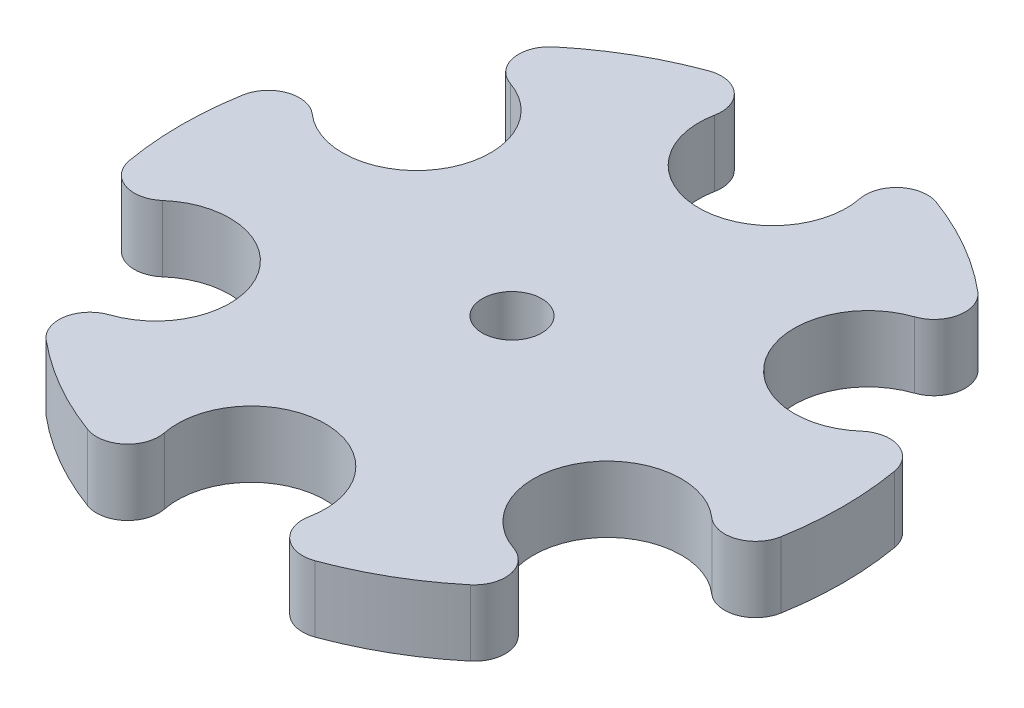
ISO-10303-21;
HEADER;
FILE_DESCRIPTION(('STEP AP214'),'2;1');
FILE_NAME('part.step','',(''),(''),'','','');
FILE_SCHEMA(('AUTOMOTIVE_DESIGN { 1 0 10303 214 1 1 1 1 }'));
ENDSEC;
DATA;
#1=APPLICATION_CONTEXT('core data for automotive mechanical design processes');
#2=APPLICATION_PROTOCOL_DEFINITION('international standard','automotive_design',2000,#1);
#3=PRODUCT_CONTEXT('',#1,'mechanical');
#4=PRODUCT('Part','Part','',(#3));
#5=PRODUCT_RELATED_PRODUCT_CATEGORY('part','',(#4));
#6=PRODUCT_DEFINITION_FORMATION('','',#4);
#7=PRODUCT_DEFINITION_CONTEXT('part definition',#1,'design');
#8=PRODUCT_DEFINITION('design','',#6,#7);
#9=PRODUCT_DEFINITION_SHAPE('','',#8);
#10=(LENGTH_UNIT() NAMED_UNIT(*) SI_UNIT(.MILLI.,.METRE.));
#11=(NAMED_UNIT(*) PLANE_ANGLE_UNIT() SI_UNIT($,.RADIAN.));
#12=(NAMED_UNIT(*) SI_UNIT($,.STERADIAN.) SOLID_ANGLE_UNIT());
#13=UNCERTAINTY_MEASURE_WITH_UNIT(LENGTH_MEASURE(1.E-05),#10,'distance_accuracy_value','');
#14=(GEOMETRIC_REPRESENTATION_CONTEXT(3) GLOBAL_UNCERTAINTY_ASSIGNED_CONTEXT((#13)) GLOBAL_UNIT_ASSIGNED_CONTEXT((#10,
#11,#12)) REPRESENTATION_CONTEXT('',''));
#15=CARTESIAN_POINT('',(0.,0.,0.));
#16=DIRECTION('',(0.,0.,1.));
#17=DIRECTION('',(1.,0.,0.));
#18=AXIS2_PLACEMENT_3D('',#15,#16,#17);
#19=CARTESIAN_POINT('',(-26.4735090378142,8.5,-72.3059701492537));
#20=DIRECTION('',(0.,-1.,0.));
#21=DIRECTION('',(0.,0.,-1.));
#22=AXIS2_PLACEMENT_3D('',#19,#20,#21);
#23=CYLINDRICAL_SURFACE('',#22,8.00000000000001);
#24=CARTESIAN_POINT('',(-26.4735090378142,-8.5,-72.3059701492537));
#25=DIRECTION('',(0.,1.,0.));
#26=DIRECTION('',(0.,0.,1.));
#27=AXIS2_PLACEMENT_3D('',#24,#25,#26);
#28=CIRCLE('',#27,8.00000000000001);
#29=CARTESIAN_POINT('',(-18.6295063599433,-8.5,-70.7338308457711));
#30=VERTEX_POINT('',#29);
#31=CARTESIAN_POINT('',(-29.2240034833014,-8.5,-79.8182787361891));
#32=VERTEX_POINT('',#31);
#33=EDGE_CURVE('E253',#30,#32,#28,.T.);
#34=ORIENTED_EDGE('',*,*,#33,.T.);
#35=DIRECTION('',(0.,-1.,0.));
#36=VECTOR('',#35,1.);
#37=CARTESIAN_POINT('',(-29.2240034833014,8.5,-79.8182787361891));
#38=LINE('',#37,#36);
#39=CARTESIAN_POINT('',(-29.2240034833014,8.5,-79.8182787361891));
#40=VERTEX_POINT('',#39);
#41=EDGE_CURVE('E12',#40,#32,#38,.T.);
#42=ORIENTED_EDGE('',*,*,#41,.F.);
#43=CARTESIAN_POINT('',(-26.4735090378142,8.5,-72.3059701492537));
#44=DIRECTION('',(0.,1.,0.));
#45=DIRECTION('',(0.,0.,1.));
#46=AXIS2_PLACEMENT_3D('',#43,#44,#45);
#47=CIRCLE('',#46,8.00000000000001);
#48=CARTESIAN_POINT('',(-18.6295063599433,8.5,-70.7338308457711));
#49=VERTEX_POINT('',#48);
#50=EDGE_CURVE('E381',#49,#40,#47,.T.);
#51=ORIENTED_EDGE('',*,*,#50,.F.);
#52=DIRECTION('',(0.,-1.,0.));
#53=VECTOR('',#52,1.);
#54=CARTESIAN_POINT('',(-18.6295063599433,8.5,-70.7338308457711));
#55=LINE('',#54,#53);
#56=EDGE_CURVE('E72',#49,#30,#55,.T.);
#57=ORIENTED_EDGE('',*,*,#56,.T.);
#58=EDGE_LOOP('',(#34,#42,#51,#57));
#59=FACE_BOUND('',#58,.T.);
#60=ADVANCED_FACE('F55',(#59),#23,.T.);
#61=CARTESIAN_POINT('',(0.,8.5,0.));
#62=DIRECTION('',(0.,-1.,0.));
#63=DIRECTION('',(0.,0.,-1.));
#64=AXIS2_PLACEMENT_3D('',#61,#62,#63);
#65=CYLINDRICAL_SURFACE('',#64,85.);
#66=CARTESIAN_POINT('',(0.,-8.5,0.));
#67=DIRECTION('',(0.,1.,0.));
#68=DIRECTION('',(0.,0.,1.));
#69=AXIS2_PLACEMENT_3D('',#66,#67,#68);
#70=CIRCLE('',#69,85.);
#71=CARTESIAN_POINT('',(-54.5126553302364,-8.5,-65.2178687849185));
#72=VERTEX_POINT('',#71);
#73=EDGE_CURVE('E255',#32,#72,#70,.T.);
#74=ORIENTED_EDGE('',*,*,#73,.T.);
#75=DIRECTION('',(0.,-1.,0.));
#76=VECTOR('',#75,1.);
#77=CARTESIAN_POINT('',(-54.5126553302364,8.5,-65.2178687849185));
#78=LINE('',#77,#76);
#79=CARTESIAN_POINT('',(-54.5126553302364,8.5,-65.2178687849185));
#80=VERTEX_POINT('',#79);
#81=EDGE_CURVE('E64',#80,#72,#78,.T.);
#82=ORIENTED_EDGE('',*,*,#81,.F.);
#83=CARTESIAN_POINT('',(0.,8.5,0.));
#84=DIRECTION('',(0.,1.,0.));
#85=DIRECTION('',(0.,0.,1.));
#86=AXIS2_PLACEMENT_3D('',#83,#84,#85);
#87=CIRCLE('',#86,85.);
#88=EDGE_CURVE('E158',#40,#80,#87,.T.);
#89=ORIENTED_EDGE('',*,*,#88,.F.);
#90=ORIENTED_EDGE('',*,*,#41,.T.);
#91=EDGE_LOOP('',(#74,#82,#89,#90));
#92=FACE_BOUND('',#91,.T.);
#93=ADVANCED_FACE('F365',(#92),#65,.T.);
#94=CARTESIAN_POINT('',(-49.3820524756259,8.5,-59.0797164286909));
#95=DIRECTION('',(0.,-1.,0.));
#96=DIRECTION('',(0.,0.,-1.));
#97=AXIS2_PLACEMENT_3D('',#94,#95,#96);
#98=CYLINDRICAL_SURFACE('',#97,7.99999999999998);
#99=CARTESIAN_POINT('',(-49.3820524756259,-8.5,-59.0797164286909));
#100=DIRECTION('',(0.,1.,0.));
#101=DIRECTION('',(0.,0.,1.));
#102=AXIS2_PLACEMENT_3D('',#99,#100,#101);
#103=CIRCLE('',#102,7.99999999999998);
#104=CARTESIAN_POINT('',(-51.9425412394574,-8.5,-51.5005411905602));
#105=VERTEX_POINT('',#104);
#106=EDGE_CURVE('E258',#105,#72,#103,.F.);
#107=ORIENTED_EDGE('',*,*,#106,.F.);
#108=DIRECTION('',(0.,-1.,0.));
#109=VECTOR('',#108,1.);
#110=CARTESIAN_POINT('',(-51.9425412394574,8.5,-51.5005411905602));
#111=LINE('',#110,#109);
#112=CARTESIAN_POINT('',(-51.9425412394574,8.5,-51.5005411905602));
#113=VERTEX_POINT('',#112);
#114=EDGE_CURVE('E358',#113,#105,#111,.T.);
#115=ORIENTED_EDGE('',*,*,#114,.F.);
#116=CARTESIAN_POINT('',(-49.3820524756259,8.5,-59.0797164286909));
#117=DIRECTION('',(0.,1.,0.));
#118=DIRECTION('',(0.,0.,1.));
#119=AXIS2_PLACEMENT_3D('',#116,#117,#118);
#120=CIRCLE('',#119,7.99999999999998);
#121=EDGE_CURVE('E364',#113,#80,#120,.F.);
#122=ORIENTED_EDGE('',*,*,#121,.T.);
#123=ORIENTED_EDGE('',*,*,#81,.T.);
#124=EDGE_LOOP('',(#107,#115,#122,#123));
#125=FACE_BOUND('',#124,.T.);
#126=ADVANCED_FACE('F362',(#125),#98,.T.);
#127=CARTESIAN_POINT('',(-58.0237020535574,8.5,-33.5));
#128=DIRECTION('',(0.,-1.,0.));
#129=DIRECTION('',(0.,0.,-1.));
#130=AXIS2_PLACEMENT_3D('',#127,#128,#129);
#131=CYLINDRICAL_SURFACE('',#130,19.);
#132=CARTESIAN_POINT('',(-58.0237020535574,-8.5,-33.5));
#133=DIRECTION('',(0.,1.,0.));
#134=DIRECTION('',(0.,0.,1.));
#135=AXIS2_PLACEMENT_3D('',#132,#133,#134);
#136=CIRCLE('',#135,19.);
#137=CARTESIAN_POINT('',(-70.5720475994007,-8.5,-19.2332896552109));
#138=VERTEX_POINT('',#137);
#139=EDGE_CURVE('E261',#138,#105,#136,.T.);
#140=ORIENTED_EDGE('',*,*,#139,.F.);
#141=DIRECTION('',(0.,-1.,0.));
#142=VECTOR('',#141,1.);
#143=CARTESIAN_POINT('',(-70.5720475994007,8.5,-19.2332896552109));
#144=LINE('',#143,#142);
#145=CARTESIAN_POINT('',(-70.5720475994007,8.5,-19.2332896552109));
#146=VERTEX_POINT('',#145);
#147=EDGE_CURVE('E356',#146,#138,#144,.T.);
#148=ORIENTED_EDGE('',*,*,#147,.F.);
#149=CARTESIAN_POINT('',(-58.0237020535574,8.5,-33.5));
#150=DIRECTION('',(0.,1.,0.));
#151=DIRECTION('',(0.,0.,1.));
#152=AXIS2_PLACEMENT_3D('',#149,#150,#151);
#153=CIRCLE('',#152,19.);
#154=EDGE_CURVE('E377',#146,#113,#153,.T.);
#155=ORIENTED_EDGE('',*,*,#154,.T.);
#156=ORIENTED_EDGE('',*,*,#114,.T.);
#157=EDGE_LOOP('',(#140,#148,#155,#156));
#158=FACE_BOUND('',#157,.T.);
#159=ADVANCED_FACE('F373',(#158),#131,.F.);
#160=CARTESIAN_POINT('',(-75.8555615134401,8.5,-13.2262537205628));
#161=DIRECTION('',(0.,-1.,0.));
#162=DIRECTION('',(0.,0.,-1.));
#163=AXIS2_PLACEMENT_3D('',#160,#161,#162);
#164=CYLINDRICAL_SURFACE('',#163,8.00000000000002);
#165=CARTESIAN_POINT('',(-75.8555615134401,-8.5,-13.2262537205628));
#166=DIRECTION('',(0.,1.,0.));
#167=DIRECTION('',(0.,0.,1.));
#168=AXIS2_PLACEMENT_3D('',#165,#166,#167);
#169=CIRCLE('',#168,8.00000000000002);
#170=CARTESIAN_POINT('',(-83.7366588135377,-8.5,-14.6004099512707));
#171=VERTEX_POINT('',#170);
#172=EDGE_CURVE('E264',#138,#171,#169,.T.);
#173=ORIENTED_EDGE('',*,*,#172,.T.);
#174=DIRECTION('',(0.,-1.,0.));
#175=VECTOR('',#174,1.);
#176=CARTESIAN_POINT('',(-83.7366588135377,8.5,-14.6004099512707));
#177=LINE('',#176,#175);
#178=CARTESIAN_POINT('',(-83.7366588135377,8.5,-14.6004099512707));
#179=VERTEX_POINT('',#178);
#180=EDGE_CURVE('E353',#179,#171,#177,.T.);
#181=ORIENTED_EDGE('',*,*,#180,.F.);
#182=CARTESIAN_POINT('',(-75.8555615134401,8.5,-13.2262537205628));
#183=DIRECTION('',(0.,1.,0.));
#184=DIRECTION('',(0.,0.,1.));
#185=AXIS2_PLACEMENT_3D('',#182,#183,#184);
#186=CIRCLE('',#185,8.00000000000002);
#187=EDGE_CURVE('E379',#146,#179,#186,.T.);
#188=ORIENTED_EDGE('',*,*,#187,.F.);
#189=ORIENTED_EDGE('',*,*,#147,.T.);
#190=EDGE_LOOP('',(#173,#181,#188,#189));
#191=FACE_BOUND('',#190,.T.);
#192=ADVANCED_FACE('F454',(#191),#164,.T.);
#193=CARTESIAN_POINT('',(0.,8.5,0.));
#194=DIRECTION('',(0.,-1.,0.));
#195=DIRECTION('',(0.,0.,-1.));
#196=AXIS2_PLACEMENT_3D('',#193,#194,#195);
#197=CYLINDRICAL_SURFACE('',#196,85.);
#198=CARTESIAN_POINT('',(0.,-8.5,0.));
#199=DIRECTION('',(0.,1.,0.));
#200=DIRECTION('',(0.,0.,1.));
#201=AXIS2_PLACEMENT_3D('',#198,#199,#200);
#202=CIRCLE('',#201,85.);
#203=CARTESIAN_POINT('',(-83.7366588135378,-8.5,14.6004099512706));
#204=VERTEX_POINT('',#203);
#205=EDGE_CURVE('E266',#171,#204,#202,.T.);
#206=ORIENTED_EDGE('',*,*,#205,.T.);
#207=DIRECTION('',(0.,-1.,0.));
#208=VECTOR('',#207,1.);
#209=CARTESIAN_POINT('',(-83.7366588135378,8.5,14.6004099512706));
#210=LINE('',#209,#208);
#211=CARTESIAN_POINT('',(-83.7366588135378,8.5,14.6004099512706));
#212=VERTEX_POINT('',#211);
#213=EDGE_CURVE('E351',#212,#204,#210,.T.);
#214=ORIENTED_EDGE('',*,*,#213,.F.);
#215=CARTESIAN_POINT('',(0.,8.5,0.));
#216=DIRECTION('',(0.,1.,0.));
#217=DIRECTION('',(0.,0.,1.));
#218=AXIS2_PLACEMENT_3D('',#215,#216,#217);
#219=CIRCLE('',#218,85.);
#220=EDGE_CURVE('E386',#179,#212,#219,.T.);
#221=ORIENTED_EDGE('',*,*,#220,.F.);
#222=ORIENTED_EDGE('',*,*,#180,.T.);
#223=EDGE_LOOP('',(#206,#214,#221,#222));
#224=FACE_BOUND('',#223,.T.);
#225=ADVANCED_FACE('F457',(#224),#197,.T.);
#226=CARTESIAN_POINT('',(-75.8555615134401,8.5,13.2262537205628));
#227=DIRECTION('',(0.,-1.,0.));
#228=DIRECTION('',(0.,0.,-1.));
#229=AXIS2_PLACEMENT_3D('',#226,#227,#228);
#230=CYLINDRICAL_SURFACE('',#229,8.);
#231=CARTESIAN_POINT('',(-75.8555615134401,-8.5,13.2262537205628));
#232=DIRECTION('',(0.,1.,0.));
#233=DIRECTION('',(0.,0.,1.));
#234=AXIS2_PLACEMENT_3D('',#231,#232,#233);
#235=CIRCLE('',#234,8.);
#236=CARTESIAN_POINT('',(-70.5720475994008,-8.5,19.2332896552109));
#237=VERTEX_POINT('',#236);
#238=EDGE_CURVE('E269',#237,#204,#235,.F.);
#239=ORIENTED_EDGE('',*,*,#238,.F.);
#240=DIRECTION('',(0.,-1.,0.));
#241=VECTOR('',#240,1.);
#242=CARTESIAN_POINT('',(-70.5720475994008,8.5,19.2332896552109));
#243=LINE('',#242,#241);
#244=CARTESIAN_POINT('',(-70.5720475994008,8.5,19.2332896552109));
#245=VERTEX_POINT('',#244);
#246=EDGE_CURVE('E349',#245,#237,#243,.T.);
#247=ORIENTED_EDGE('',*,*,#246,.F.);
#248=CARTESIAN_POINT('',(-75.8555615134401,8.5,13.2262537205628));
#249=DIRECTION('',(0.,1.,0.));
#250=DIRECTION('',(0.,0.,1.));
#251=AXIS2_PLACEMENT_3D('',#248,#249,#250);
#252=CIRCLE('',#251,8.);
#253=EDGE_CURVE('E388',#245,#212,#252,.F.);
#254=ORIENTED_EDGE('',*,*,#253,.T.);
#255=ORIENTED_EDGE('',*,*,#213,.T.);
#256=EDGE_LOOP('',(#239,#247,#254,#255));
#257=FACE_BOUND('',#256,.T.);
#258=ADVANCED_FACE('F461',(#257),#230,.T.);
#259=CARTESIAN_POINT('',(-58.0237020535574,8.5,33.5));
#260=DIRECTION('',(0.,-1.,0.));
#261=DIRECTION('',(0.,0.,-1.));
#262=AXIS2_PLACEMENT_3D('',#259,#260,#261);
#263=CYLINDRICAL_SURFACE('',#262,19.);
#264=CARTESIAN_POINT('',(-58.0237020535574,-8.5,33.5));
#265=DIRECTION('',(0.,1.,0.));
#266=DIRECTION('',(0.,0.,1.));
#267=AXIS2_PLACEMENT_3D('',#264,#265,#266);
#268=CIRCLE('',#267,19.);
#269=CARTESIAN_POINT('',(-51.9425412394575,-8.5,51.5005411905602));
#270=VERTEX_POINT('',#269);
#271=EDGE_CURVE('E272',#270,#237,#268,.T.);
#272=ORIENTED_EDGE('',*,*,#271,.F.);
#273=DIRECTION('',(0.,-1.,0.));
#274=VECTOR('',#273,1.);
#275=CARTESIAN_POINT('',(-51.9425412394575,8.5,51.5005411905602));
#276=LINE('',#275,#274);
#277=CARTESIAN_POINT('',(-51.9425412394575,8.5,51.5005411905602));
#278=VERTEX_POINT('',#277);
#279=EDGE_CURVE('E347',#278,#270,#276,.T.);
#280=ORIENTED_EDGE('',*,*,#279,.F.);
#281=CARTESIAN_POINT('',(-58.0237020535574,8.5,33.5));
#282=DIRECTION('',(0.,1.,0.));
#283=DIRECTION('',(0.,0.,1.));
#284=AXIS2_PLACEMENT_3D('',#281,#282,#283);
#285=CIRCLE('',#284,19.);
#286=EDGE_CURVE('E391',#278,#245,#285,.T.);
#287=ORIENTED_EDGE('',*,*,#286,.T.);
#288=ORIENTED_EDGE('',*,*,#246,.T.);
#289=EDGE_LOOP('',(#272,#280,#287,#288));
#290=FACE_BOUND('',#289,.T.);
#291=ADVANCED_FACE('F465',(#290),#263,.F.);
#292=CARTESIAN_POINT('',(-49.3820524756259,8.5,59.0797164286908));
#293=DIRECTION('',(0.,-1.,0.));
#294=DIRECTION('',(0.,0.,-1.));
#295=AXIS2_PLACEMENT_3D('',#292,#293,#294);
#296=CYLINDRICAL_SURFACE('',#295,8.00000000000003);
#297=CARTESIAN_POINT('',(-49.3820524756259,-8.5,59.0797164286908));
#298=DIRECTION('',(0.,1.,0.));
#299=DIRECTION('',(0.,0.,1.));
#300=AXIS2_PLACEMENT_3D('',#297,#298,#299);
#301=CIRCLE('',#300,8.00000000000003);
#302=CARTESIAN_POINT('',(-54.5126553302364,-8.5,65.2178687849185));
#303=VERTEX_POINT('',#302);
#304=EDGE_CURVE('E275',#270,#303,#301,.T.);
#305=ORIENTED_EDGE('',*,*,#304,.T.);
#306=DIRECTION('',(0.,-1.,0.));
#307=VECTOR('',#306,1.);
#308=CARTESIAN_POINT('',(-54.5126553302364,8.5,65.2178687849185));
#309=LINE('',#308,#307);
#310=CARTESIAN_POINT('',(-54.5126553302364,8.5,65.2178687849185));
#311=VERTEX_POINT('',#310);
#312=EDGE_CURVE('E344',#311,#303,#309,.T.);
#313=ORIENTED_EDGE('',*,*,#312,.F.);
#314=CARTESIAN_POINT('',(-49.3820524756259,8.5,59.0797164286908));
#315=DIRECTION('',(0.,1.,0.));
#316=DIRECTION('',(0.,0.,1.));
#317=AXIS2_PLACEMENT_3D('',#314,#315,#316);
#318=CIRCLE('',#317,8.00000000000003);
#319=EDGE_CURVE('E394',#278,#311,#318,.T.);
#320=ORIENTED_EDGE('',*,*,#319,.F.);
#321=ORIENTED_EDGE('',*,*,#279,.T.);
#322=EDGE_LOOP('',(#305,#313,#320,#321));
#323=FACE_BOUND('',#322,.T.);
#324=ADVANCED_FACE('F469',(#323),#296,.T.);
#325=CARTESIAN_POINT('',(0.,8.5,0.));
#326=DIRECTION('',(0.,-1.,0.));
#327=DIRECTION('',(0.,0.,-1.));
#328=AXIS2_PLACEMENT_3D('',#325,#326,#327);
#329=CYLINDRICAL_SURFACE('',#328,85.);
#330=CARTESIAN_POINT('',(0.,-8.5,0.));
#331=DIRECTION('',(0.,1.,0.));
#332=DIRECTION('',(0.,0.,1.));
#333=AXIS2_PLACEMENT_3D('',#330,#331,#332);
#334=CIRCLE('',#333,85.);
#335=CARTESIAN_POINT('',(-29.2240034833014,-8.5,79.8182787361891));
#336=VERTEX_POINT('',#335);
#337=EDGE_CURVE('E277',#303,#336,#334,.T.);
#338=ORIENTED_EDGE('',*,*,#337,.T.);
#339=DIRECTION('',(0.,-1.,0.));
#340=VECTOR('',#339,1.);
#341=CARTESIAN_POINT('',(-29.2240034833014,8.5,79.8182787361891));
#342=LINE('',#341,#340);
#343=CARTESIAN_POINT('',(-29.2240034833014,8.5,79.8182787361891));
#344=VERTEX_POINT('',#343);
#345=EDGE_CURVE('E342',#344,#336,#342,.T.);
#346=ORIENTED_EDGE('',*,*,#345,.F.);
#347=CARTESIAN_POINT('',(0.,8.5,0.));
#348=DIRECTION('',(0.,1.,0.));
#349=DIRECTION('',(0.,0.,1.));
#350=AXIS2_PLACEMENT_3D('',#347,#348,#349);
#351=CIRCLE('',#350,85.);
#352=EDGE_CURVE('E396',#311,#344,#351,.T.);
#353=ORIENTED_EDGE('',*,*,#352,.F.);
#354=ORIENTED_EDGE('',*,*,#312,.T.);
#355=EDGE_LOOP('',(#338,#346,#353,#354));
#356=FACE_BOUND('',#355,.T.);
#357=ADVANCED_FACE('F473',(#356),#329,.T.);
#358=CARTESIAN_POINT('',(-26.4735090378142,8.5,72.3059701492537));
#359=DIRECTION('',(0.,-1.,0.));
#360=DIRECTION('',(0.,0.,-1.));
#361=AXIS2_PLACEMENT_3D('',#358,#359,#360);
#362=CYLINDRICAL_SURFACE('',#361,8.);
#363=CARTESIAN_POINT('',(-26.4735090378142,-8.5,72.3059701492537));
#364=DIRECTION('',(0.,1.,0.));
#365=DIRECTION('',(0.,0.,1.));
#366=AXIS2_PLACEMENT_3D('',#363,#364,#365);
#367=CIRCLE('',#366,8.);
#368=CARTESIAN_POINT('',(-18.6295063599433,-8.5,70.7338308457711));
#369=VERTEX_POINT('',#368);
#370=EDGE_CURVE('E280',#369,#336,#367,.F.);
#371=ORIENTED_EDGE('',*,*,#370,.F.);
#372=DIRECTION('',(0.,-1.,0.));
#373=VECTOR('',#372,1.);
#374=CARTESIAN_POINT('',(-18.6295063599433,8.5,70.7338308457711));
#375=LINE('',#374,#373);
#376=CARTESIAN_POINT('',(-18.6295063599433,8.5,70.7338308457711));
#377=VERTEX_POINT('',#376);
#378=EDGE_CURVE('E340',#377,#369,#375,.T.);
#379=ORIENTED_EDGE('',*,*,#378,.F.);
#380=CARTESIAN_POINT('',(-26.4735090378142,8.5,72.3059701492537));
#381=DIRECTION('',(0.,1.,0.));
#382=DIRECTION('',(0.,0.,1.));
#383=AXIS2_PLACEMENT_3D('',#380,#381,#382);
#384=CIRCLE('',#383,8.);
#385=EDGE_CURVE('E398',#377,#344,#384,.F.);
#386=ORIENTED_EDGE('',*,*,#385,.T.);
#387=ORIENTED_EDGE('',*,*,#345,.T.);
#388=EDGE_LOOP('',(#371,#379,#386,#387));
#389=FACE_BOUND('',#388,.T.);
#390=ADVANCED_FACE('F477',(#389),#362,.T.);
#391=CARTESIAN_POINT('',(0.,8.5,66.9999999999999));
#392=DIRECTION('',(0.,-1.,0.));
#393=DIRECTION('',(0.,0.,-1.));
#394=AXIS2_PLACEMENT_3D('',#391,#392,#393);
#395=CYLINDRICAL_SURFACE('',#394,19.);
#396=CARTESIAN_POINT('',(0.,-8.5,66.9999999999999));
#397=DIRECTION('',(0.,1.,0.));
#398=DIRECTION('',(0.,0.,1.));
#399=AXIS2_PLACEMENT_3D('',#396,#397,#398);
#400=CIRCLE('',#399,19.);
#401=CARTESIAN_POINT('',(18.6295063599432,-8.5,70.7338308457711));
#402=VERTEX_POINT('',#401);
#403=EDGE_CURVE('E283',#402,#369,#400,.T.);
#404=ORIENTED_EDGE('',*,*,#403,.F.);
#405=DIRECTION('',(0.,-1.,0.));
#406=VECTOR('',#405,1.);
#407=CARTESIAN_POINT('',(18.6295063599432,8.5,70.7338308457711));
#408=LINE('',#407,#406);
#409=CARTESIAN_POINT('',(18.6295063599432,8.5,70.7338308457711));
#410=VERTEX_POINT('',#409);
#411=EDGE_CURVE('E338',#410,#402,#408,.T.);
#412=ORIENTED_EDGE('',*,*,#411,.F.);
#413=CARTESIAN_POINT('',(0.,8.5,66.9999999999999));
#414=DIRECTION('',(0.,1.,0.));
#415=DIRECTION('',(0.,0.,1.));
#416=AXIS2_PLACEMENT_3D('',#413,#414,#415);
#417=CIRCLE('',#416,19.);
#418=EDGE_CURVE('E401',#410,#377,#417,.T.);
#419=ORIENTED_EDGE('',*,*,#418,.T.);
#420=ORIENTED_EDGE('',*,*,#378,.T.);
#421=EDGE_LOOP('',(#404,#412,#419,#420));
#422=FACE_BOUND('',#421,.T.);
#423=ADVANCED_FACE('F481',(#422),#395,.F.);
#424=CARTESIAN_POINT('',(26.4735090378141,8.5,72.3059701492536));
#425=DIRECTION('',(0.,-1.,0.));
#426=DIRECTION('',(0.,0.,-1.));
#427=AXIS2_PLACEMENT_3D('',#424,#425,#426);
#428=CYLINDRICAL_SURFACE('',#427,8.00000000000004);
#429=CARTESIAN_POINT('',(26.4735090378141,-8.5,72.3059701492536));
#430=DIRECTION('',(0.,1.,0.));
#431=DIRECTION('',(0.,0.,1.));
#432=AXIS2_PLACEMENT_3D('',#429,#430,#431);
#433=CIRCLE('',#432,8.00000000000004);
#434=CARTESIAN_POINT('',(29.2240034833013,-8.5,79.8182787361891));
#435=VERTEX_POINT('',#434);
#436=EDGE_CURVE('E286',#402,#435,#433,.T.);
#437=ORIENTED_EDGE('',*,*,#436,.T.);
#438=DIRECTION('',(0.,-1.,0.));
#439=VECTOR('',#438,1.);
#440=CARTESIAN_POINT('',(29.2240034833013,8.5,79.8182787361891));
#441=LINE('',#440,#439);
#442=CARTESIAN_POINT('',(29.2240034833013,8.5,79.8182787361891));
#443=VERTEX_POINT('',#442);
#444=EDGE_CURVE('E335',#443,#435,#441,.T.);
#445=ORIENTED_EDGE('',*,*,#444,.F.);
#446=CARTESIAN_POINT('',(26.4735090378141,8.5,72.3059701492536));
#447=DIRECTION('',(0.,1.,0.));
#448=DIRECTION('',(0.,0.,1.));
#449=AXIS2_PLACEMENT_3D('',#446,#447,#448);
#450=CIRCLE('',#449,8.00000000000004);
#451=EDGE_CURVE('E404',#410,#443,#450,.T.);
#452=ORIENTED_EDGE('',*,*,#451,.F.);
#453=ORIENTED_EDGE('',*,*,#411,.T.);
#454=EDGE_LOOP('',(#437,#445,#452,#453));
#455=FACE_BOUND('',#454,.T.);
#456=ADVANCED_FACE('F485',(#455),#428,.T.);
#457=CARTESIAN_POINT('',(0.,8.5,0.));
#458=DIRECTION('',(0.,-1.,0.));
#459=DIRECTION('',(0.,0.,-1.));
#460=AXIS2_PLACEMENT_3D('',#457,#458,#459);
#461=CYLINDRICAL_SURFACE('',#460,85.);
#462=CARTESIAN_POINT('',(0.,-8.5,0.));
#463=DIRECTION('',(0.,1.,0.));
#464=DIRECTION('',(0.,0.,1.));
#465=AXIS2_PLACEMENT_3D('',#462,#463,#464);
#466=CIRCLE('',#465,85.);
#467=CARTESIAN_POINT('',(54.5126553302364,-8.5,65.2178687849185));
#468=VERTEX_POINT('',#467);
#469=EDGE_CURVE('E288',#435,#468,#466,.T.);
#470=ORIENTED_EDGE('',*,*,#469,.T.);
#471=DIRECTION('',(0.,-1.,0.));
#472=VECTOR('',#471,1.);
#473=CARTESIAN_POINT('',(54.5126553302364,8.5,65.2178687849185));
#474=LINE('',#473,#472);
#475=CARTESIAN_POINT('',(54.5126553302364,8.5,65.2178687849185));
#476=VERTEX_POINT('',#475);
#477=EDGE_CURVE('E333',#476,#468,#474,.T.);
#478=ORIENTED_EDGE('',*,*,#477,.F.);
#479=CARTESIAN_POINT('',(0.,8.5,0.));
#480=DIRECTION('',(0.,1.,0.));
#481=DIRECTION('',(0.,0.,1.));
#482=AXIS2_PLACEMENT_3D('',#479,#480,#481);
#483=CIRCLE('',#482,85.);
#484=EDGE_CURVE('E406',#443,#476,#483,.T.);
#485=ORIENTED_EDGE('',*,*,#484,.F.);
#486=ORIENTED_EDGE('',*,*,#444,.T.);
#487=EDGE_LOOP('',(#470,#478,#485,#486));
#488=FACE_BOUND('',#487,.T.);
#489=ADVANCED_FACE('F489',(#488),#461,.T.);
#490=CARTESIAN_POINT('',(49.3820524756259,8.5,59.0797164286908));
#491=DIRECTION('',(0.,-1.,0.));
#492=DIRECTION('',(0.,0.,-1.));
#493=AXIS2_PLACEMENT_3D('',#490,#491,#492);
#494=CYLINDRICAL_SURFACE('',#493,8.00000000000003);
#495=CARTESIAN_POINT('',(49.3820524756259,-8.5,59.0797164286908));
#496=DIRECTION('',(0.,1.,0.));
#497=DIRECTION('',(0.,0.,1.));
#498=AXIS2_PLACEMENT_3D('',#495,#496,#497);
#499=CIRCLE('',#498,8.00000000000003);
#500=CARTESIAN_POINT('',(51.9425412394574,-8.5,51.5005411905602));
#501=VERTEX_POINT('',#500);
#502=EDGE_CURVE('E291',#501,#468,#499,.F.);
#503=ORIENTED_EDGE('',*,*,#502,.F.);
#504=DIRECTION('',(0.,-1.,0.));
#505=VECTOR('',#504,1.);
#506=CARTESIAN_POINT('',(51.9425412394574,8.5,51.5005411905602));
#507=LINE('',#506,#505);
#508=CARTESIAN_POINT('',(51.9425412394574,8.5,51.5005411905602));
#509=VERTEX_POINT('',#508);
#510=EDGE_CURVE('E331',#509,#501,#507,.T.);
#511=ORIENTED_EDGE('',*,*,#510,.F.);
#512=CARTESIAN_POINT('',(49.3820524756259,8.5,59.0797164286908));
#513=DIRECTION('',(0.,1.,0.));
#514=DIRECTION('',(0.,0.,1.));
#515=AXIS2_PLACEMENT_3D('',#512,#513,#514);
#516=CIRCLE('',#515,8.00000000000003);
#517=EDGE_CURVE('E408',#509,#476,#516,.F.);
#518=ORIENTED_EDGE('',*,*,#517,.T.);
#519=ORIENTED_EDGE('',*,*,#477,.T.);
#520=EDGE_LOOP('',(#503,#511,#518,#519));
#521=FACE_BOUND('',#520,.T.);
#522=ADVANCED_FACE('F493',(#521),#494,.T.);
#523=CARTESIAN_POINT('',(58.0237020535574,8.5,33.5));
#524=DIRECTION('',(0.,-1.,0.));
#525=DIRECTION('',(0.,0.,-1.));
#526=AXIS2_PLACEMENT_3D('',#523,#524,#525);
#527=CYLINDRICAL_SURFACE('',#526,19.);
#528=CARTESIAN_POINT('',(58.0237020535574,-8.5,33.5));
#529=DIRECTION('',(0.,1.,0.));
#530=DIRECTION('',(0.,0.,1.));
#531=AXIS2_PLACEMENT_3D('',#528,#529,#530);
#532=CIRCLE('',#531,19.);
#533=CARTESIAN_POINT('',(70.5720475994006,-8.5,19.2332896552109));
#534=VERTEX_POINT('',#533);
#535=EDGE_CURVE('E294',#534,#501,#532,.T.);
#536=ORIENTED_EDGE('',*,*,#535,.F.);
#537=DIRECTION('',(0.,-1.,0.));
#538=VECTOR('',#537,1.);
#539=CARTESIAN_POINT('',(70.5720475994006,8.5,19.2332896552109));
#540=LINE('',#539,#538);
#541=CARTESIAN_POINT('',(70.5720475994006,8.5,19.2332896552109));
#542=VERTEX_POINT('',#541);
#543=EDGE_CURVE('E329',#542,#534,#540,.T.);
#544=ORIENTED_EDGE('',*,*,#543,.F.);
#545=CARTESIAN_POINT('',(58.0237020535574,8.5,33.5));
#546=DIRECTION('',(0.,1.,0.));
#547=DIRECTION('',(0.,0.,1.));
#548=AXIS2_PLACEMENT_3D('',#545,#546,#547);
#549=CIRCLE('',#548,19.);
#550=EDGE_CURVE('E411',#542,#509,#549,.T.);
#551=ORIENTED_EDGE('',*,*,#550,.T.);
#552=ORIENTED_EDGE('',*,*,#510,.T.);
#553=EDGE_LOOP('',(#536,#544,#551,#552));
#554=FACE_BOUND('',#553,.T.);
#555=ADVANCED_FACE('F497',(#554),#527,.F.);
#556=CARTESIAN_POINT('',(75.85556151344,8.5,13.2262537205628));
#557=DIRECTION('',(0.,-1.,0.));
#558=DIRECTION('',(0.,0.,-1.));
#559=AXIS2_PLACEMENT_3D('',#556,#557,#558);
#560=CYLINDRICAL_SURFACE('',#559,8.00000000000007);
#561=CARTESIAN_POINT('',(75.85556151344,-8.5,13.2262537205628));
#562=DIRECTION('',(0.,1.,0.));
#563=DIRECTION('',(0.,0.,1.));
#564=AXIS2_PLACEMENT_3D('',#561,#562,#563);
#565=CIRCLE('',#564,8.00000000000007);
#566=CARTESIAN_POINT('',(83.7366588135378,-8.5,14.6004099512706));
#567=VERTEX_POINT('',#566);
#568=EDGE_CURVE('E297',#534,#567,#565,.T.);
#569=ORIENTED_EDGE('',*,*,#568,.T.);
#570=DIRECTION('',(0.,-1.,0.));
#571=VECTOR('',#570,1.);
#572=CARTESIAN_POINT('',(83.7366588135378,8.5,14.6004099512706));
#573=LINE('',#572,#571);
#574=CARTESIAN_POINT('',(83.7366588135378,8.5,14.6004099512706));
#575=VERTEX_POINT('',#574);
#576=EDGE_CURVE('E326',#575,#567,#573,.T.);
#577=ORIENTED_EDGE('',*,*,#576,.F.);
#578=CARTESIAN_POINT('',(75.85556151344,8.5,13.2262537205628));
#579=DIRECTION('',(0.,1.,0.));
#580=DIRECTION('',(0.,0.,1.));
#581=AXIS2_PLACEMENT_3D('',#578,#579,#580);
#582=CIRCLE('',#581,8.00000000000007);
#583=EDGE_CURVE('E414',#542,#575,#582,.T.);
#584=ORIENTED_EDGE('',*,*,#583,.F.);
#585=ORIENTED_EDGE('',*,*,#543,.T.);
#586=EDGE_LOOP('',(#569,#577,#584,#585));
#587=FACE_BOUND('',#586,.T.);
#588=ADVANCED_FACE('F501',(#587),#560,.T.);
#589=CARTESIAN_POINT('',(0.,8.5,0.));
#590=DIRECTION('',(0.,-1.,0.));
#591=DIRECTION('',(0.,0.,-1.));
#592=AXIS2_PLACEMENT_3D('',#589,#590,#591);
#593=CYLINDRICAL_SURFACE('',#592,85.);
#594=CARTESIAN_POINT('',(0.,-8.5,0.));
#595=DIRECTION('',(0.,1.,0.));
#596=DIRECTION('',(0.,0.,1.));
#597=AXIS2_PLACEMENT_3D('',#594,#595,#596);
#598=CIRCLE('',#597,85.);
#599=CARTESIAN_POINT('',(83.7366588135377,-8.5,-14.6004099512707));
#600=VERTEX_POINT('',#599);
#601=EDGE_CURVE('E299',#567,#600,#598,.T.);
#602=ORIENTED_EDGE('',*,*,#601,.T.);
#603=DIRECTION('',(0.,-1.,0.));
#604=VECTOR('',#603,1.);
#605=CARTESIAN_POINT('',(83.7366588135377,8.5,-14.6004099512707));
#606=LINE('',#605,#604);
#607=CARTESIAN_POINT('',(83.7366588135377,8.5,-14.6004099512707));
#608=VERTEX_POINT('',#607);
#609=EDGE_CURVE('E324',#608,#600,#606,.T.);
#610=ORIENTED_EDGE('',*,*,#609,.F.);
#611=CARTESIAN_POINT('',(0.,8.5,0.));
#612=DIRECTION('',(0.,1.,0.));
#613=DIRECTION('',(0.,0.,1.));
#614=AXIS2_PLACEMENT_3D('',#611,#612,#613);
#615=CIRCLE('',#614,85.);
#616=EDGE_CURVE('E416',#575,#608,#615,.T.);
#617=ORIENTED_EDGE('',*,*,#616,.F.);
#618=ORIENTED_EDGE('',*,*,#576,.T.);
#619=EDGE_LOOP('',(#602,#610,#617,#618));
#620=FACE_BOUND('',#619,.T.);
#621=ADVANCED_FACE('F505',(#620),#593,.T.);
#622=CARTESIAN_POINT('',(75.8555615134401,8.5,-13.2262537205629));
#623=DIRECTION('',(0.,-1.,0.));
#624=DIRECTION('',(0.,0.,-1.));
#625=AXIS2_PLACEMENT_3D('',#622,#623,#624);
#626=CYLINDRICAL_SURFACE('',#625,8.00000000000002);
#627=CARTESIAN_POINT('',(75.8555615134401,-8.5,-13.2262537205629));
#628=DIRECTION('',(0.,1.,0.));
#629=DIRECTION('',(0.,0.,1.));
#630=AXIS2_PLACEMENT_3D('',#627,#628,#629);
#631=CIRCLE('',#630,8.00000000000002);
#632=CARTESIAN_POINT('',(70.5720475994007,-8.5,-19.2332896552109));
#633=VERTEX_POINT('',#632);
#634=EDGE_CURVE('E302',#633,#600,#631,.F.);
#635=ORIENTED_EDGE('',*,*,#634,.F.);
#636=DIRECTION('',(0.,-1.,0.));
#637=VECTOR('',#636,1.);
#638=CARTESIAN_POINT('',(70.5720475994007,8.5,-19.2332896552109));
#639=LINE('',#638,#637);
#640=CARTESIAN_POINT('',(70.5720475994007,8.5,-19.2332896552109));
#641=VERTEX_POINT('',#640);
#642=EDGE_CURVE('E322',#641,#633,#639,.T.);
#643=ORIENTED_EDGE('',*,*,#642,.F.);
#644=CARTESIAN_POINT('',(75.8555615134401,8.5,-13.2262537205629));
#645=DIRECTION('',(0.,1.,0.));
#646=DIRECTION('',(0.,0.,1.));
#647=AXIS2_PLACEMENT_3D('',#644,#645,#646);
#648=CIRCLE('',#647,8.00000000000002);
#649=EDGE_CURVE('E418',#641,#608,#648,.F.);
#650=ORIENTED_EDGE('',*,*,#649,.T.);
#651=ORIENTED_EDGE('',*,*,#609,.T.);
#652=EDGE_LOOP('',(#635,#643,#650,#651));
#653=FACE_BOUND('',#652,.T.);
#654=ADVANCED_FACE('F431',(#653),#626,.T.);
#655=CARTESIAN_POINT('',(58.0237020535574,8.5,-33.5));
#656=DIRECTION('',(0.,-1.,0.));
#657=DIRECTION('',(0.,0.,-1.));
#658=AXIS2_PLACEMENT_3D('',#655,#656,#657);
#659=CYLINDRICAL_SURFACE('',#658,19.);
#660=CARTESIAN_POINT('',(58.0237020535574,-8.5,-33.5));
#661=DIRECTION('',(0.,1.,0.));
#662=DIRECTION('',(0.,0.,1.));
#663=AXIS2_PLACEMENT_3D('',#660,#661,#662);
#664=CIRCLE('',#663,19.);
#665=CARTESIAN_POINT('',(51.9425412394574,-8.5,-51.5005411905602));
#666=VERTEX_POINT('',#665);
#667=EDGE_CURVE('E305',#666,#633,#664,.T.);
#668=ORIENTED_EDGE('',*,*,#667,.F.);
#669=DIRECTION('',(0.,-1.,0.));
#670=VECTOR('',#669,1.);
#671=CARTESIAN_POINT('',(51.9425412394574,8.5,-51.5005411905602));
#672=LINE('',#671,#670);
#673=CARTESIAN_POINT('',(51.9425412394574,8.5,-51.5005411905602));
#674=VERTEX_POINT('',#673);
#675=EDGE_CURVE('E320',#674,#666,#672,.T.);
#676=ORIENTED_EDGE('',*,*,#675,.F.);
#677=CARTESIAN_POINT('',(58.0237020535574,8.5,-33.5));
#678=DIRECTION('',(0.,1.,0.));
#679=DIRECTION('',(0.,0.,1.));
#680=AXIS2_PLACEMENT_3D('',#677,#678,#679);
#681=CIRCLE('',#680,19.);
#682=EDGE_CURVE('E421',#674,#641,#681,.T.);
#683=ORIENTED_EDGE('',*,*,#682,.T.);
#684=ORIENTED_EDGE('',*,*,#642,.T.);
#685=EDGE_LOOP('',(#668,#676,#683,#684));
#686=FACE_BOUND('',#685,.T.);
#687=ADVANCED_FACE('F425',(#686),#659,.F.);
#688=CARTESIAN_POINT('',(49.3820524756259,8.5,-59.0797164286908));
#689=DIRECTION('',(0.,-1.,0.));
#690=DIRECTION('',(0.,0.,-1.));
#691=AXIS2_PLACEMENT_3D('',#688,#689,#690);
#692=CYLINDRICAL_SURFACE('',#691,8.00000000000004);
#693=CARTESIAN_POINT('',(49.3820524756259,-8.5,-59.0797164286908));
#694=DIRECTION('',(0.,1.,0.));
#695=DIRECTION('',(0.,0.,1.));
#696=AXIS2_PLACEMENT_3D('',#693,#694,#695);
#697=CIRCLE('',#696,8.00000000000004);
#698=CARTESIAN_POINT('',(54.5126553302364,-8.5,-65.2178687849185));
#699=VERTEX_POINT('',#698);
#700=EDGE_CURVE('E308',#666,#699,#697,.T.);
#701=ORIENTED_EDGE('',*,*,#700,.T.);
#702=DIRECTION('',(0.,-1.,0.));
#703=VECTOR('',#702,1.);
#704=CARTESIAN_POINT('',(54.5126553302364,8.5,-65.2178687849185));
#705=LINE('',#704,#703);
#706=CARTESIAN_POINT('',(54.5126553302364,8.5,-65.2178687849185));
#707=VERTEX_POINT('',#706);
#708=EDGE_CURVE('E242',#707,#699,#705,.T.);
#709=ORIENTED_EDGE('',*,*,#708,.F.);
#710=CARTESIAN_POINT('',(49.3820524756259,8.5,-59.0797164286908));
#711=DIRECTION('',(0.,1.,0.));
#712=DIRECTION('',(0.,0.,1.));
#713=AXIS2_PLACEMENT_3D('',#710,#711,#712);
#714=CIRCLE('',#713,8.00000000000004);
#715=EDGE_CURVE('E230',#674,#707,#714,.T.);
#716=ORIENTED_EDGE('',*,*,#715,.F.);
#717=ORIENTED_EDGE('',*,*,#675,.T.);
#718=EDGE_LOOP('',(#701,#709,#716,#717));
#719=FACE_BOUND('',#718,.T.);
#720=ADVANCED_FACE('F435',(#719),#692,.T.);
#721=CARTESIAN_POINT('',(0.,8.5,0.));
#722=DIRECTION('',(0.,-1.,0.));
#723=DIRECTION('',(0.,0.,-1.));
#724=AXIS2_PLACEMENT_3D('',#721,#722,#723);
#725=CYLINDRICAL_SURFACE('',#724,85.);
#726=CARTESIAN_POINT('',(0.,-8.5,0.));
#727=DIRECTION('',(0.,1.,0.));
#728=DIRECTION('',(0.,0.,1.));
#729=AXIS2_PLACEMENT_3D('',#726,#727,#728);
#730=CIRCLE('',#729,85.);
#731=CARTESIAN_POINT('',(29.2240034833014,-8.5,-79.8182787361892));
#732=VERTEX_POINT('',#731);
#733=EDGE_CURVE('E239',#699,#732,#730,.T.);
#734=ORIENTED_EDGE('',*,*,#733,.T.);
#735=DIRECTION('',(0.,-1.,0.));
#736=VECTOR('',#735,1.);
#737=CARTESIAN_POINT('',(29.2240034833014,8.5,-79.8182787361892));
#738=LINE('',#737,#736);
#739=CARTESIAN_POINT('',(29.2240034833014,8.5,-79.8182787361892));
#740=VERTEX_POINT('',#739);
#741=EDGE_CURVE('E236',#740,#732,#738,.T.);
#742=ORIENTED_EDGE('',*,*,#741,.F.);
#743=CARTESIAN_POINT('',(0.,8.5,0.));
#744=DIRECTION('',(0.,1.,0.));
#745=DIRECTION('',(0.,0.,1.));
#746=AXIS2_PLACEMENT_3D('',#743,#744,#745);
#747=CIRCLE('',#746,85.);
#748=EDGE_CURVE('E222',#707,#740,#747,.T.);
#749=ORIENTED_EDGE('',*,*,#748,.F.);
#750=ORIENTED_EDGE('',*,*,#708,.T.);
#751=EDGE_LOOP('',(#734,#742,#749,#750));
#752=FACE_BOUND('',#751,.T.);
#753=ADVANCED_FACE('F237',(#752),#725,.T.);
#754=CARTESIAN_POINT('',(26.4735090378142,8.5,-72.3059701492537));
#755=DIRECTION('',(0.,-1.,0.));
#756=DIRECTION('',(0.,0.,-1.));
#757=AXIS2_PLACEMENT_3D('',#754,#755,#756);
#758=CYLINDRICAL_SURFACE('',#757,8.00000000000001);
#759=CARTESIAN_POINT('',(26.4735090378142,-8.5,-72.3059701492537));
#760=DIRECTION('',(0.,1.,0.));
#761=DIRECTION('',(0.,0.,1.));
#762=AXIS2_PLACEMENT_3D('',#759,#760,#761);
#763=CIRCLE('',#762,8.00000000000001);
#764=CARTESIAN_POINT('',(18.6295063599433,-8.5,-70.7338308457711));
#765=VERTEX_POINT('',#764);
#766=EDGE_CURVE('E311',#765,#732,#763,.F.);
#767=ORIENTED_EDGE('',*,*,#766,.F.);
#768=DIRECTION('',(0.,-1.,0.));
#769=VECTOR('',#768,1.);
#770=CARTESIAN_POINT('',(18.6295063599433,8.5,-70.7338308457711));
#771=LINE('',#770,#769);
#772=CARTESIAN_POINT('',(18.6295063599433,8.5,-70.7338308457711));
#773=VERTEX_POINT('',#772);
#774=EDGE_CURVE('E146',#773,#765,#771,.T.);
#775=ORIENTED_EDGE('',*,*,#774,.F.);
#776=CARTESIAN_POINT('',(26.4735090378142,8.5,-72.3059701492537));
#777=DIRECTION('',(0.,1.,0.));
#778=DIRECTION('',(0.,0.,1.));
#779=AXIS2_PLACEMENT_3D('',#776,#777,#778);
#780=CIRCLE('',#779,8.00000000000001);
#781=EDGE_CURVE('E227',#773,#740,#780,.F.);
#782=ORIENTED_EDGE('',*,*,#781,.T.);
#783=ORIENTED_EDGE('',*,*,#741,.T.);
#784=EDGE_LOOP('',(#767,#775,#782,#783));
#785=FACE_BOUND('',#784,.T.);
#786=ADVANCED_FACE('F244',(#785),#758,.T.);
#787=CARTESIAN_POINT('',(0.,8.5,0.));
#788=DIRECTION('',(0.,-1.,0.));
#789=DIRECTION('',(0.,0.,-1.));
#790=AXIS2_PLACEMENT_3D('',#787,#788,#789);
#791=CYLINDRICAL_SURFACE('',#790,7.65);
#792=CARTESIAN_POINT('',(0.,8.5,0.));
#793=DIRECTION('',(0.,1.,0.));
#794=DIRECTION('',(0.,0.,1.));
#795=AXIS2_PLACEMENT_3D('',#792,#793,#794);
#796=CIRCLE('',#795,7.65);
#797=CARTESIAN_POINT('',(0.,8.5,7.65));
#798=VERTEX_POINT('',#797);
#799=EDGE_CURVE('E316',#798,#798,#796,.T.);
#800=ORIENTED_EDGE('',*,*,#799,.T.);
#801=EDGE_LOOP('',(#800));
#802=FACE_BOUND('',#801,.T.);
#803=CARTESIAN_POINT('',(0.,-8.5,0.));
#804=DIRECTION('',(0.,1.,0.));
#805=DIRECTION('',(0.,0.,1.));
#806=AXIS2_PLACEMENT_3D('',#803,#804,#805);
#807=CIRCLE('',#806,7.65);
#808=CARTESIAN_POINT('',(0.,-8.5,7.65));
#809=VERTEX_POINT('',#808);
#810=EDGE_CURVE('E250',#809,#809,#807,.T.);
#811=ORIENTED_EDGE('',*,*,#810,.F.);
#812=EDGE_LOOP('',(#811));
#813=FACE_BOUND('',#812,.T.);
#814=ADVANCED_FACE('F57',(#802,#813),#791,.F.);
#815=CARTESIAN_POINT('',(0.,8.5,-67.));
#816=DIRECTION('',(0.,-1.,0.));
#817=DIRECTION('',(0.,0.,-1.));
#818=AXIS2_PLACEMENT_3D('',#815,#816,#817);
#819=CYLINDRICAL_SURFACE('',#818,19.);
#820=CARTESIAN_POINT('',(0.,-8.5,-67.));
#821=DIRECTION('',(0.,1.,0.));
#822=DIRECTION('',(0.,0.,1.));
#823=AXIS2_PLACEMENT_3D('',#820,#821,#822);
#824=CIRCLE('',#823,19.);
#825=EDGE_CURVE('E313',#30,#765,#824,.T.);
#826=ORIENTED_EDGE('',*,*,#825,.F.);
#827=ORIENTED_EDGE('',*,*,#56,.F.);
#828=CARTESIAN_POINT('',(0.,8.5,-67.));
#829=DIRECTION('',(0.,1.,0.));
#830=DIRECTION('',(0.,0.,1.));
#831=AXIS2_PLACEMENT_3D('',#828,#829,#830);
#832=CIRCLE('',#831,19.);
#833=EDGE_CURVE('E245',#49,#773,#832,.T.);
#834=ORIENTED_EDGE('',*,*,#833,.T.);
#835=ORIENTED_EDGE('',*,*,#774,.T.);
#836=EDGE_LOOP('',(#826,#827,#834,#835));
#837=FACE_BOUND('',#836,.T.);
#838=ADVANCED_FACE('F547',(#837),#819,.F.);
#839=CARTESIAN_POINT('',(0.,8.5,0.));
#840=DIRECTION('',(0.,1.,0.));
#841=DIRECTION('',(0.,0.,1.));
#842=AXIS2_PLACEMENT_3D('',#839,#840,#841);
#843=PLANE('',#842);
#844=ORIENTED_EDGE('',*,*,#799,.F.);
#845=EDGE_LOOP('',(#844));
#846=FACE_BOUND('',#845,.T.);
#847=ORIENTED_EDGE('',*,*,#50,.T.);
#848=ORIENTED_EDGE('',*,*,#88,.T.);
#849=ORIENTED_EDGE('',*,*,#121,.F.);
#850=ORIENTED_EDGE('',*,*,#154,.F.);
#851=ORIENTED_EDGE('',*,*,#187,.T.);
#852=ORIENTED_EDGE('',*,*,#220,.T.);
#853=ORIENTED_EDGE('',*,*,#253,.F.);
#854=ORIENTED_EDGE('',*,*,#286,.F.);
#855=ORIENTED_EDGE('',*,*,#319,.T.);
#856=ORIENTED_EDGE('',*,*,#352,.T.);
#857=ORIENTED_EDGE('',*,*,#385,.F.);
#858=ORIENTED_EDGE('',*,*,#418,.F.);
#859=ORIENTED_EDGE('',*,*,#451,.T.);
#860=ORIENTED_EDGE('',*,*,#484,.T.);
#861=ORIENTED_EDGE('',*,*,#517,.F.);
#862=ORIENTED_EDGE('',*,*,#550,.F.);
#863=ORIENTED_EDGE('',*,*,#583,.T.);
#864=ORIENTED_EDGE('',*,*,#616,.T.);
#865=ORIENTED_EDGE('',*,*,#649,.F.);
#866=ORIENTED_EDGE('',*,*,#682,.F.);
#867=ORIENTED_EDGE('',*,*,#715,.T.);
#868=ORIENTED_EDGE('',*,*,#748,.T.);
#869=ORIENTED_EDGE('',*,*,#781,.F.);
#870=ORIENTED_EDGE('',*,*,#833,.F.);
#871=EDGE_LOOP('',(#847,#848,#849,#850,#851,#852,#853,#854,#855,#856,#857,#858,#859,#860,#861,
#862,#863,#864,#865,#866,#867,#868,#869,#870));
#872=FACE_BOUND('',#871,.T.);
#873=ADVANCED_FACE('F224',(#846,#872),#843,.T.);
#874=CARTESIAN_POINT('',(0.,-8.5,0.));
#875=DIRECTION('',(0.,1.,0.));
#876=DIRECTION('',(0.,0.,1.));
#877=AXIS2_PLACEMENT_3D('',#874,#875,#876);
#878=PLANE('',#877);
#879=ORIENTED_EDGE('',*,*,#810,.T.);
#880=EDGE_LOOP('',(#879));
#881=FACE_BOUND('',#880,.T.);
#882=ORIENTED_EDGE('',*,*,#33,.F.);
#883=ORIENTED_EDGE('',*,*,#825,.T.);
#884=ORIENTED_EDGE('',*,*,#766,.T.);
#885=ORIENTED_EDGE('',*,*,#733,.F.);
#886=ORIENTED_EDGE('',*,*,#700,.F.);
#887=ORIENTED_EDGE('',*,*,#667,.T.);
#888=ORIENTED_EDGE('',*,*,#634,.T.);
#889=ORIENTED_EDGE('',*,*,#601,.F.);
#890=ORIENTED_EDGE('',*,*,#568,.F.);
#891=ORIENTED_EDGE('',*,*,#535,.T.);
#892=ORIENTED_EDGE('',*,*,#502,.T.);
#893=ORIENTED_EDGE('',*,*,#469,.F.);
#894=ORIENTED_EDGE('',*,*,#436,.F.);
#895=ORIENTED_EDGE('',*,*,#403,.T.);
#896=ORIENTED_EDGE('',*,*,#370,.T.);
#897=ORIENTED_EDGE('',*,*,#337,.F.);
#898=ORIENTED_EDGE('',*,*,#304,.F.);
#899=ORIENTED_EDGE('',*,*,#271,.T.);
#900=ORIENTED_EDGE('',*,*,#238,.T.);
#901=ORIENTED_EDGE('',*,*,#205,.F.);
#902=ORIENTED_EDGE('',*,*,#172,.F.);
#903=ORIENTED_EDGE('',*,*,#139,.T.);
#904=ORIENTED_EDGE('',*,*,#106,.T.);
#905=ORIENTED_EDGE('',*,*,#73,.F.);
#906=EDGE_LOOP('',(#882,#883,#884,#885,#886,#887,#888,#889,#890,#891,#892,#893,#894,#895,#896,
#897,#898,#899,#900,#901,#902,#903,#904,#905));
#907=FACE_BOUND('',#906,.T.);
#908=ADVANCED_FACE('F368',(#881,#907),#878,.F.);
#909=CLOSED_SHELL('',(#60,#93,#126,#159,#192,#225,#258,#291,#324,#357,#390,#423,#456,#489,#522,
#555,#588,#621,#654,#687,#720,#753,#786,#814,#838,#873,#908));
#910=MANIFOLD_SOLID_BREP('B2',#909);
#911=ADVANCED_BREP_SHAPE_REPRESENTATION('',(#18,#910),#14);
#912=SHAPE_DEFINITION_REPRESENTATION(#9,#911);
ENDSEC;
END-ISO-10303-21;
